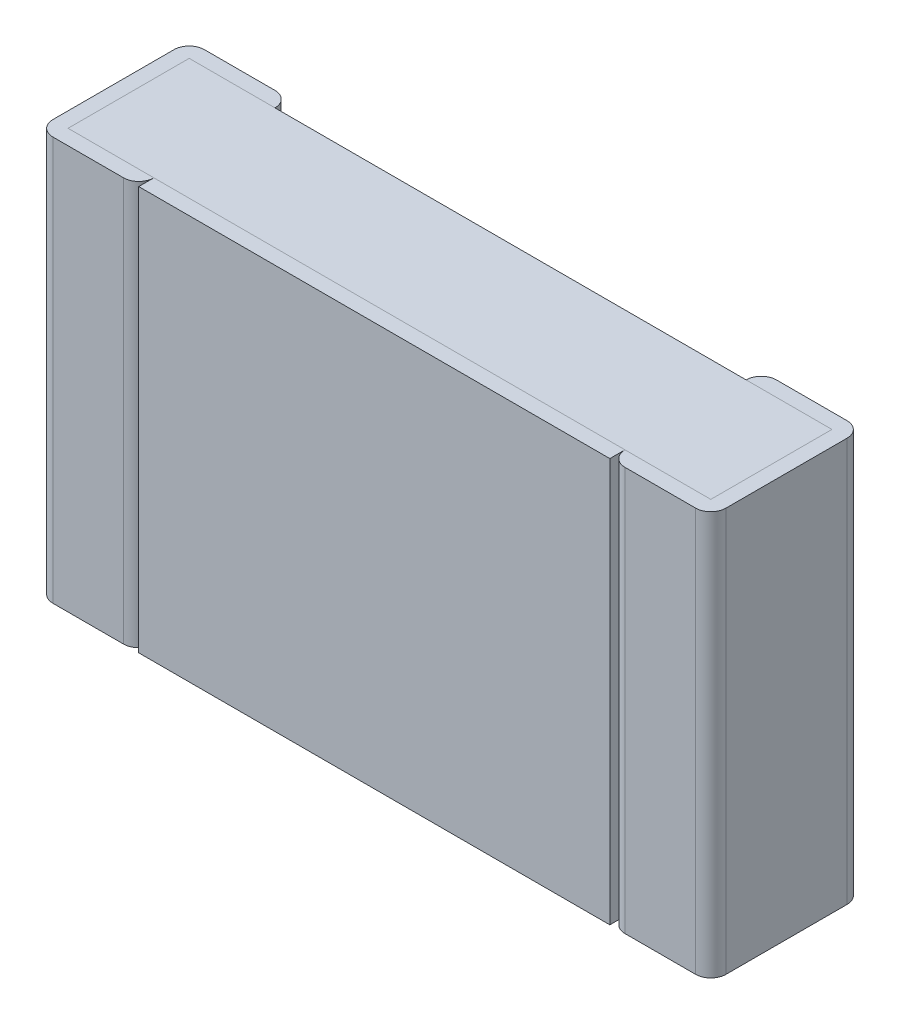
ISO-10303-21;
HEADER;
FILE_DESCRIPTION(('STEP AP214'),'2;1');
FILE_NAME('part.step','',(''),(''),'','','');
FILE_SCHEMA(('AUTOMOTIVE_DESIGN { 1 0 10303 214 1 1 1 1 }'));
ENDSEC;
DATA;
#1=APPLICATION_CONTEXT('core data for automotive mechanical design processes');
#2=APPLICATION_PROTOCOL_DEFINITION('international standard','automotive_design',2000,#1);
#3=PRODUCT_CONTEXT('',#1,'mechanical');
#4=PRODUCT('Part','Part','',(#3));
#5=PRODUCT_RELATED_PRODUCT_CATEGORY('part','',(#4));
#6=PRODUCT_DEFINITION_FORMATION('','',#4);
#7=PRODUCT_DEFINITION_CONTEXT('part definition',#1,'design');
#8=PRODUCT_DEFINITION('design','',#6,#7);
#9=PRODUCT_DEFINITION_SHAPE('','',#8);
#10=(LENGTH_UNIT() NAMED_UNIT(*) SI_UNIT(.MILLI.,.METRE.));
#11=(NAMED_UNIT(*) PLANE_ANGLE_UNIT() SI_UNIT($,.RADIAN.));
#12=(NAMED_UNIT(*) SI_UNIT($,.STERADIAN.) SOLID_ANGLE_UNIT());
#13=UNCERTAINTY_MEASURE_WITH_UNIT(LENGTH_MEASURE(1.E-05),#10,'distance_accuracy_value','');
#14=(GEOMETRIC_REPRESENTATION_CONTEXT(3) GLOBAL_UNCERTAINTY_ASSIGNED_CONTEXT((#13)) GLOBAL_UNIT_ASSIGNED_CONTEXT((#10,
#11,#12)) REPRESENTATION_CONTEXT('',''));
#15=CARTESIAN_POINT('',(0.,0.,0.));
#16=DIRECTION('',(0.,0.,1.));
#17=DIRECTION('',(1.,0.,0.));
#18=AXIS2_PLACEMENT_3D('',#15,#16,#17);
#19=CARTESIAN_POINT('',(-0.7,-0.6,0.45));
#20=DIRECTION('',(0.,0.,1.));
#21=DIRECTION('',(1.,0.,0.));
#22=AXIS2_PLACEMENT_3D('',#19,#20,#21);
#23=PLANE('',#22);
#24=DIRECTION('',(0.,1.,0.));
#25=VECTOR('',#24,1.);
#26=CARTESIAN_POINT('',(-0.7,-0.6,0.45));
#27=LINE('',#26,#25);
#28=CARTESIAN_POINT('',(-0.7,-0.6,0.45));
#29=VERTEX_POINT('',#28);
#30=CARTESIAN_POINT('',(-0.7,0.6,0.45));
#31=VERTEX_POINT('',#30);
#32=EDGE_CURVE('E380',#29,#31,#27,.T.);
#33=ORIENTED_EDGE('',*,*,#32,.F.);
#34=DIRECTION('',(1.,0.,0.));
#35=VECTOR('',#34,1.);
#36=CARTESIAN_POINT('',(-0.7,-0.6,0.45));
#37=LINE('',#36,#35);
#38=CARTESIAN_POINT('',(0.7,-0.6,0.45));
#39=VERTEX_POINT('',#38);
#40=EDGE_CURVE('E368',#29,#39,#37,.T.);
#41=ORIENTED_EDGE('',*,*,#40,.T.);
#42=DIRECTION('',(0.,1.,0.));
#43=VECTOR('',#42,1.);
#44=CARTESIAN_POINT('',(0.7,-0.6,0.45));
#45=LINE('',#44,#43);
#46=CARTESIAN_POINT('',(0.7,0.6,0.45));
#47=VERTEX_POINT('',#46);
#48=EDGE_CURVE('E11',#39,#47,#45,.T.);
#49=ORIENTED_EDGE('',*,*,#48,.T.);
#50=DIRECTION('',(1.,0.,0.));
#51=VECTOR('',#50,1.);
#52=CARTESIAN_POINT('',(-0.7,0.6,0.45));
#53=LINE('',#52,#51);
#54=EDGE_CURVE('E247',#31,#47,#53,.T.);
#55=ORIENTED_EDGE('',*,*,#54,.F.);
#56=EDGE_LOOP('',(#33,#41,#49,#55));
#57=FACE_BOUND('',#56,.T.);
#58=ADVANCED_FACE('F17',(#57),#23,.T.);
#59=CARTESIAN_POINT('',(0.7,-0.6,0.405));
#60=DIRECTION('',(1.,0.,0.));
#61=DIRECTION('',(0.,1.,0.));
#62=AXIS2_PLACEMENT_3D('',#59,#60,#61);
#63=PLANE('',#62);
#64=DIRECTION('',(0.,0.,1.));
#65=VECTOR('',#64,1.);
#66=CARTESIAN_POINT('',(0.7,-0.6,0.405));
#67=LINE('',#66,#65);
#68=CARTESIAN_POINT('',(0.7,-0.6,0.405));
#69=VERTEX_POINT('',#68);
#70=EDGE_CURVE('E347',#69,#39,#67,.T.);
#71=ORIENTED_EDGE('',*,*,#70,.F.);
#72=DIRECTION('',(0.,1.,0.));
#73=VECTOR('',#72,1.);
#74=CARTESIAN_POINT('',(0.7,-0.6,0.405));
#75=LINE('',#74,#73);
#76=CARTESIAN_POINT('',(0.7,0.6,0.405));
#77=VERTEX_POINT('',#76);
#78=EDGE_CURVE('E28',#69,#77,#75,.T.);
#79=ORIENTED_EDGE('',*,*,#78,.T.);
#80=DIRECTION('',(0.,0.,1.));
#81=VECTOR('',#80,1.);
#82=CARTESIAN_POINT('',(0.7,0.6,0.405));
#83=LINE('',#82,#81);
#84=EDGE_CURVE('E249',#77,#47,#83,.T.);
#85=ORIENTED_EDGE('',*,*,#84,.T.);
#86=ORIENTED_EDGE('',*,*,#48,.F.);
#87=EDGE_LOOP('',(#71,#79,#85,#86));
#88=FACE_BOUND('',#87,.T.);
#89=ADVANCED_FACE('F532',(#88),#63,.T.);
#90=CARTESIAN_POINT('',(0.745,-0.6,0.405));
#91=DIRECTION('',(0.,1.,0.));
#92=DIRECTION('',(-1.,0.,0.));
#93=AXIS2_PLACEMENT_3D('',#90,#91,#92);
#94=CYLINDRICAL_SURFACE('',#93,0.045);
#95=CARTESIAN_POINT('',(0.745,-0.6,0.405));
#96=DIRECTION('',(0.,1.,0.));
#97=DIRECTION('',(0.,0.,1.));
#98=AXIS2_PLACEMENT_3D('',#95,#96,#97);
#99=CIRCLE('',#98,0.045);
#100=CARTESIAN_POINT('',(0.745,-0.6,0.45));
#101=VERTEX_POINT('',#100);
#102=EDGE_CURVE('E21',#69,#101,#99,.T.);
#103=ORIENTED_EDGE('',*,*,#102,.T.);
#104=DIRECTION('',(0.,1.,0.));
#105=VECTOR('',#104,1.);
#106=CARTESIAN_POINT('',(0.745,-0.6,0.45));
#107=LINE('',#106,#105);
#108=CARTESIAN_POINT('',(0.745,0.6,0.45));
#109=VERTEX_POINT('',#108);
#110=EDGE_CURVE('E245',#101,#109,#107,.T.);
#111=ORIENTED_EDGE('',*,*,#110,.T.);
#112=CARTESIAN_POINT('',(0.745,0.6,0.405));
#113=DIRECTION('',(0.,1.,0.));
#114=DIRECTION('',(0.,0.,1.));
#115=AXIS2_PLACEMENT_3D('',#112,#113,#114);
#116=CIRCLE('',#115,0.045);
#117=EDGE_CURVE('E278',#77,#109,#116,.T.);
#118=ORIENTED_EDGE('',*,*,#117,.F.);
#119=ORIENTED_EDGE('',*,*,#78,.F.);
#120=EDGE_LOOP('',(#103,#111,#118,#119));
#121=FACE_BOUND('',#120,.T.);
#122=ADVANCED_FACE('F535',(#121),#94,.T.);
#123=CARTESIAN_POINT('',(0.7,-0.6,0.45));
#124=DIRECTION('',(0.,0.,1.));
#125=DIRECTION('',(1.,0.,0.));
#126=AXIS2_PLACEMENT_3D('',#123,#124,#125);
#127=PLANE('',#126);
#128=DIRECTION('',(1.,0.,0.));
#129=VECTOR('',#128,1.);
#130=CARTESIAN_POINT('',(0.7,0.6,0.45));
#131=LINE('',#130,#129);
#132=CARTESIAN_POINT('',(0.955,0.6,0.45));
#133=VERTEX_POINT('',#132);
#134=EDGE_CURVE('E281',#109,#133,#131,.T.);
#135=ORIENTED_EDGE('',*,*,#134,.F.);
#136=ORIENTED_EDGE('',*,*,#110,.F.);
#137=DIRECTION('',(1.,0.,0.));
#138=VECTOR('',#137,1.);
#139=CARTESIAN_POINT('',(0.7,-0.6,0.45));
#140=LINE('',#139,#138);
#141=CARTESIAN_POINT('',(0.955,-0.6,0.45));
#142=VERTEX_POINT('',#141);
#143=EDGE_CURVE('E306',#101,#142,#140,.T.);
#144=ORIENTED_EDGE('',*,*,#143,.T.);
#145=DIRECTION('',(0.,1.,0.));
#146=VECTOR('',#145,1.);
#147=CARTESIAN_POINT('',(0.955,-0.6,0.45));
#148=LINE('',#147,#146);
#149=EDGE_CURVE('E292',#142,#133,#148,.T.);
#150=ORIENTED_EDGE('',*,*,#149,.T.);
#151=EDGE_LOOP('',(#135,#136,#144,#150));
#152=FACE_BOUND('',#151,.T.);
#153=ADVANCED_FACE('F553',(#152),#127,.T.);
#154=CARTESIAN_POINT('',(0.955,-0.6,0.405));
#155=DIRECTION('',(0.,1.,0.));
#156=DIRECTION('',(1.,0.,0.));
#157=AXIS2_PLACEMENT_3D('',#154,#155,#156);
#158=CYLINDRICAL_SURFACE('',#157,0.045);
#159=DIRECTION('',(0.,1.,0.));
#160=VECTOR('',#159,1.);
#161=CARTESIAN_POINT('',(1.,-0.6,0.405));
#162=LINE('',#161,#160);
#163=CARTESIAN_POINT('',(1.,-0.6,0.405));
#164=VERTEX_POINT('',#163);
#165=CARTESIAN_POINT('',(1.,0.6,0.405));
#166=VERTEX_POINT('',#165);
#167=EDGE_CURVE('E295',#164,#166,#162,.T.);
#168=ORIENTED_EDGE('',*,*,#167,.T.);
#169=CARTESIAN_POINT('',(0.955,0.6,0.405));
#170=DIRECTION('',(0.,-1.,0.));
#171=DIRECTION('',(0.,0.,1.));
#172=AXIS2_PLACEMENT_3D('',#169,#170,#171);
#173=CIRCLE('',#172,0.045);
#174=EDGE_CURVE('E273',#166,#133,#173,.T.);
#175=ORIENTED_EDGE('',*,*,#174,.T.);
#176=ORIENTED_EDGE('',*,*,#149,.F.);
#177=CARTESIAN_POINT('',(0.955,-0.6,0.405));
#178=DIRECTION('',(0.,-1.,0.));
#179=DIRECTION('',(0.,0.,1.));
#180=AXIS2_PLACEMENT_3D('',#177,#178,#179);
#181=CIRCLE('',#180,0.045);
#182=EDGE_CURVE('E302',#164,#142,#181,.T.);
#183=ORIENTED_EDGE('',*,*,#182,.F.);
#184=EDGE_LOOP('',(#168,#175,#176,#183));
#185=FACE_BOUND('',#184,.T.);
#186=ADVANCED_FACE('F550',(#185),#158,.T.);
#187=CARTESIAN_POINT('',(1.,-0.6,0.));
#188=DIRECTION('',(1.,0.,0.));
#189=DIRECTION('',(0.,1.,0.));
#190=AXIS2_PLACEMENT_3D('',#187,#188,#189);
#191=PLANE('',#190);
#192=DIRECTION('',(0.,0.,1.));
#193=VECTOR('',#192,1.);
#194=CARTESIAN_POINT('',(1.,-0.6,0.));
#195=LINE('',#194,#193);
#196=CARTESIAN_POINT('',(1.,-0.6,0.045));
#197=VERTEX_POINT('',#196);
#198=EDGE_CURVE('E307',#197,#164,#195,.T.);
#199=ORIENTED_EDGE('',*,*,#198,.F.);
#200=DIRECTION('',(0.,1.,0.));
#201=VECTOR('',#200,1.);
#202=CARTESIAN_POINT('',(1.,-0.6,0.045));
#203=LINE('',#202,#201);
#204=CARTESIAN_POINT('',(1.,0.6,0.045));
#205=VERTEX_POINT('',#204);
#206=EDGE_CURVE('E332',#197,#205,#203,.T.);
#207=ORIENTED_EDGE('',*,*,#206,.T.);
#208=DIRECTION('',(0.,0.,1.));
#209=VECTOR('',#208,1.);
#210=CARTESIAN_POINT('',(1.,0.6,0.));
#211=LINE('',#210,#209);
#212=EDGE_CURVE('E261',#205,#166,#211,.T.);
#213=ORIENTED_EDGE('',*,*,#212,.T.);
#214=ORIENTED_EDGE('',*,*,#167,.F.);
#215=EDGE_LOOP('',(#199,#207,#213,#214));
#216=FACE_BOUND('',#215,.T.);
#217=ADVANCED_FACE('F547',(#216),#191,.T.);
#218=CARTESIAN_POINT('',(0.955,-0.6,0.045));
#219=DIRECTION('',(0.,1.,0.));
#220=DIRECTION('',(1.,0.,0.));
#221=AXIS2_PLACEMENT_3D('',#218,#219,#220);
#222=CYLINDRICAL_SURFACE('',#221,0.045);
#223=CARTESIAN_POINT('',(0.955,-0.6,0.045));
#224=DIRECTION('',(0.,1.,0.));
#225=DIRECTION('',(0.,0.,1.));
#226=AXIS2_PLACEMENT_3D('',#223,#224,#225);
#227=CIRCLE('',#226,0.045);
#228=CARTESIAN_POINT('',(0.955,-0.6,0.));
#229=VERTEX_POINT('',#228);
#230=EDGE_CURVE('E360',#197,#229,#227,.T.);
#231=ORIENTED_EDGE('',*,*,#230,.T.);
#232=DIRECTION('',(0.,1.,0.));
#233=VECTOR('',#232,1.);
#234=CARTESIAN_POINT('',(0.955,-0.6,0.));
#235=LINE('',#234,#233);
#236=CARTESIAN_POINT('',(0.955,0.6,0.));
#237=VERTEX_POINT('',#236);
#238=EDGE_CURVE('E339',#229,#237,#235,.T.);
#239=ORIENTED_EDGE('',*,*,#238,.T.);
#240=CARTESIAN_POINT('',(0.955,0.6,0.045));
#241=DIRECTION('',(0.,1.,0.));
#242=DIRECTION('',(0.,0.,1.));
#243=AXIS2_PLACEMENT_3D('',#240,#241,#242);
#244=CIRCLE('',#243,0.045);
#245=EDGE_CURVE('E250',#205,#237,#244,.T.);
#246=ORIENTED_EDGE('',*,*,#245,.F.);
#247=ORIENTED_EDGE('',*,*,#206,.F.);
#248=EDGE_LOOP('',(#231,#239,#246,#247));
#249=FACE_BOUND('',#248,.T.);
#250=ADVANCED_FACE('F544',(#249),#222,.T.);
#251=CARTESIAN_POINT('',(0.7,-0.6,0.));
#252=DIRECTION('',(0.,0.,1.));
#253=DIRECTION('',(1.,0.,0.));
#254=AXIS2_PLACEMENT_3D('',#251,#252,#253);
#255=PLANE('',#254);
#256=ORIENTED_EDGE('',*,*,#238,.F.);
#257=DIRECTION('',(1.,0.,0.));
#258=VECTOR('',#257,1.);
#259=CARTESIAN_POINT('',(0.7,-0.6,0.));
#260=LINE('',#259,#258);
#261=CARTESIAN_POINT('',(0.745,-0.6,0.));
#262=VERTEX_POINT('',#261);
#263=EDGE_CURVE('E344',#262,#229,#260,.T.);
#264=ORIENTED_EDGE('',*,*,#263,.F.);
#265=DIRECTION('',(0.,1.,0.));
#266=VECTOR('',#265,1.);
#267=CARTESIAN_POINT('',(0.745,-0.6,0.));
#268=LINE('',#267,#266);
#269=CARTESIAN_POINT('',(0.745,0.6,0.));
#270=VERTEX_POINT('',#269);
#271=EDGE_CURVE('E257',#262,#270,#268,.T.);
#272=ORIENTED_EDGE('',*,*,#271,.T.);
#273=DIRECTION('',(1.,0.,0.));
#274=VECTOR('',#273,1.);
#275=CARTESIAN_POINT('',(0.7,0.6,0.));
#276=LINE('',#275,#274);
#277=EDGE_CURVE('E364',#270,#237,#276,.T.);
#278=ORIENTED_EDGE('',*,*,#277,.T.);
#279=EDGE_LOOP('',(#256,#264,#272,#278));
#280=FACE_BOUND('',#279,.T.);
#281=ADVANCED_FACE('F542',(#280),#255,.F.);
#282=CARTESIAN_POINT('',(0.745,-0.6,0.045));
#283=DIRECTION('',(0.,1.,0.));
#284=DIRECTION('',(-1.,0.,0.));
#285=AXIS2_PLACEMENT_3D('',#282,#283,#284);
#286=CYLINDRICAL_SURFACE('',#285,0.045);
#287=DIRECTION('',(0.,1.,0.));
#288=VECTOR('',#287,1.);
#289=CARTESIAN_POINT('',(0.7,-0.6,0.045));
#290=LINE('',#289,#288);
#291=CARTESIAN_POINT('',(0.7,-0.6,0.045));
#292=VERTEX_POINT('',#291);
#293=CARTESIAN_POINT('',(0.7,0.6,0.045));
#294=VERTEX_POINT('',#293);
#295=EDGE_CURVE('E337',#292,#294,#290,.T.);
#296=ORIENTED_EDGE('',*,*,#295,.T.);
#297=CARTESIAN_POINT('',(0.745,0.6,0.045));
#298=DIRECTION('',(0.,-1.,0.));
#299=DIRECTION('',(0.,0.,1.));
#300=AXIS2_PLACEMENT_3D('',#297,#298,#299);
#301=CIRCLE('',#300,0.045);
#302=EDGE_CURVE('E282',#294,#270,#301,.T.);
#303=ORIENTED_EDGE('',*,*,#302,.T.);
#304=ORIENTED_EDGE('',*,*,#271,.F.);
#305=CARTESIAN_POINT('',(0.745,-0.6,0.045));
#306=DIRECTION('',(0.,-1.,0.));
#307=DIRECTION('',(0.,0.,1.));
#308=AXIS2_PLACEMENT_3D('',#305,#306,#307);
#309=CIRCLE('',#308,0.045);
#310=EDGE_CURVE('E348',#292,#262,#309,.T.);
#311=ORIENTED_EDGE('',*,*,#310,.F.);
#312=EDGE_LOOP('',(#296,#303,#304,#311));
#313=FACE_BOUND('',#312,.T.);
#314=ADVANCED_FACE('F539',(#313),#286,.T.);
#315=CARTESIAN_POINT('',(-0.7,0.6,0.405));
#316=DIRECTION('',(0.,1.,0.));
#317=DIRECTION('',(1.,0.,0.));
#318=AXIS2_PLACEMENT_3D('',#315,#316,#317);
#319=PLANE('',#318);
#320=DIRECTION('',(1.,0.,0.));
#321=VECTOR('',#320,1.);
#322=CARTESIAN_POINT('',(-0.7,0.6,0.405));
#323=LINE('',#322,#321);
#324=CARTESIAN_POINT('',(-0.7,0.6,0.405));
#325=VERTEX_POINT('',#324);
#326=EDGE_CURVE('E296',#325,#77,#323,.T.);
#327=ORIENTED_EDGE('',*,*,#326,.F.);
#328=DIRECTION('',(0.,0.,1.));
#329=VECTOR('',#328,1.);
#330=CARTESIAN_POINT('',(-0.7,0.6,0.405));
#331=LINE('',#330,#329);
#332=EDGE_CURVE('E391',#325,#31,#331,.T.);
#333=ORIENTED_EDGE('',*,*,#332,.T.);
#334=ORIENTED_EDGE('',*,*,#54,.T.);
#335=ORIENTED_EDGE('',*,*,#84,.F.);
#336=EDGE_LOOP('',(#327,#333,#334,#335));
#337=FACE_BOUND('',#336,.T.);
#338=ADVANCED_FACE('F523',(#337),#319,.T.);
#339=CARTESIAN_POINT('',(0.7,0.6,0.));
#340=DIRECTION('',(0.,1.,0.));
#341=DIRECTION('',(1.,0.,0.));
#342=AXIS2_PLACEMENT_3D('',#339,#340,#341);
#343=PLANE('',#342);
#344=ORIENTED_EDGE('',*,*,#277,.F.);
#345=ORIENTED_EDGE('',*,*,#302,.F.);
#346=DIRECTION('',(1.,0.,0.));
#347=VECTOR('',#346,1.);
#348=CARTESIAN_POINT('',(-0.955,0.6,0.045));
#349=LINE('',#348,#347);
#350=CARTESIAN_POINT('',(0.955,0.6,0.045));
#351=VERTEX_POINT('',#350);
#352=EDGE_CURVE('E317',#294,#351,#349,.T.);
#353=ORIENTED_EDGE('',*,*,#352,.T.);
#354=DIRECTION('',(0.,0.,1.));
#355=VECTOR('',#354,1.);
#356=CARTESIAN_POINT('',(0.955,0.6,0.045));
#357=LINE('',#356,#355);
#358=CARTESIAN_POINT('',(0.955,0.6,0.405));
#359=VERTEX_POINT('',#358);
#360=EDGE_CURVE('E314',#351,#359,#357,.T.);
#361=ORIENTED_EDGE('',*,*,#360,.T.);
#362=DIRECTION('',(1.,0.,0.));
#363=VECTOR('',#362,1.);
#364=CARTESIAN_POINT('',(-0.955,0.6,0.405));
#365=LINE('',#364,#363);
#366=EDGE_CURVE('E300',#77,#359,#365,.T.);
#367=ORIENTED_EDGE('',*,*,#366,.F.);
#368=ORIENTED_EDGE('',*,*,#117,.T.);
#369=ORIENTED_EDGE('',*,*,#134,.T.);
#370=ORIENTED_EDGE('',*,*,#174,.F.);
#371=ORIENTED_EDGE('',*,*,#212,.F.);
#372=ORIENTED_EDGE('',*,*,#245,.T.);
#373=EDGE_LOOP('',(#344,#345,#353,#361,#367,#368,#369,#370,#371,#372));
#374=FACE_BOUND('',#373,.T.);
#375=ADVANCED_FACE('F538',(#374),#343,.T.);
#376=CARTESIAN_POINT('',(-0.7,-0.6,0.405));
#377=DIRECTION('',(1.,0.,0.));
#378=DIRECTION('',(0.,1.,0.));
#379=AXIS2_PLACEMENT_3D('',#376,#377,#378);
#380=PLANE('',#379);
#381=ORIENTED_EDGE('',*,*,#32,.T.);
#382=ORIENTED_EDGE('',*,*,#332,.F.);
#383=DIRECTION('',(0.,1.,0.));
#384=VECTOR('',#383,1.);
#385=CARTESIAN_POINT('',(-0.7,-0.6,0.405));
#386=LINE('',#385,#384);
#387=CARTESIAN_POINT('',(-0.7,-0.6,0.405));
#388=VERTEX_POINT('',#387);
#389=EDGE_CURVE('E301',#388,#325,#386,.T.);
#390=ORIENTED_EDGE('',*,*,#389,.F.);
#391=DIRECTION('',(0.,0.,1.));
#392=VECTOR('',#391,1.);
#393=CARTESIAN_POINT('',(-0.7,-0.6,0.405));
#394=LINE('',#393,#392);
#395=EDGE_CURVE('E376',#388,#29,#394,.T.);
#396=ORIENTED_EDGE('',*,*,#395,.T.);
#397=EDGE_LOOP('',(#381,#382,#390,#396));
#398=FACE_BOUND('',#397,.T.);
#399=ADVANCED_FACE('F521',(#398),#380,.F.);
#400=CARTESIAN_POINT('',(-0.7,-0.6,0.405));
#401=DIRECTION('',(0.,1.,0.));
#402=DIRECTION('',(1.,0.,0.));
#403=AXIS2_PLACEMENT_3D('',#400,#401,#402);
#404=PLANE('',#403);
#405=ORIENTED_EDGE('',*,*,#70,.T.);
#406=ORIENTED_EDGE('',*,*,#40,.F.);
#407=ORIENTED_EDGE('',*,*,#395,.F.);
#408=DIRECTION('',(1.,0.,0.));
#409=VECTOR('',#408,1.);
#410=CARTESIAN_POINT('',(-0.7,-0.6,0.405));
#411=LINE('',#410,#409);
#412=EDGE_CURVE('E310',#388,#69,#411,.T.);
#413=ORIENTED_EDGE('',*,*,#412,.T.);
#414=EDGE_LOOP('',(#405,#406,#407,#413));
#415=FACE_BOUND('',#414,.T.);
#416=ADVANCED_FACE('F517',(#415),#404,.F.);
#417=CARTESIAN_POINT('',(0.7,-0.6,0.));
#418=DIRECTION('',(0.,1.,0.));
#419=DIRECTION('',(1.,0.,0.));
#420=AXIS2_PLACEMENT_3D('',#417,#418,#419);
#421=PLANE('',#420);
#422=ORIENTED_EDGE('',*,*,#230,.F.);
#423=ORIENTED_EDGE('',*,*,#198,.T.);
#424=ORIENTED_EDGE('',*,*,#182,.T.);
#425=ORIENTED_EDGE('',*,*,#143,.F.);
#426=ORIENTED_EDGE('',*,*,#102,.F.);
#427=DIRECTION('',(1.,0.,0.));
#428=VECTOR('',#427,1.);
#429=CARTESIAN_POINT('',(-0.955,-0.6,0.405));
#430=LINE('',#429,#428);
#431=CARTESIAN_POINT('',(0.955,-0.6,0.405));
#432=VERTEX_POINT('',#431);
#433=EDGE_CURVE('E287',#69,#432,#430,.T.);
#434=ORIENTED_EDGE('',*,*,#433,.T.);
#435=DIRECTION('',(0.,0.,1.));
#436=VECTOR('',#435,1.);
#437=CARTESIAN_POINT('',(0.955,-0.6,0.045));
#438=LINE('',#437,#436);
#439=CARTESIAN_POINT('',(0.955,-0.6,0.045));
#440=VERTEX_POINT('',#439);
#441=EDGE_CURVE('E283',#440,#432,#438,.T.);
#442=ORIENTED_EDGE('',*,*,#441,.F.);
#443=DIRECTION('',(1.,0.,0.));
#444=VECTOR('',#443,1.);
#445=CARTESIAN_POINT('',(-0.955,-0.6,0.045));
#446=LINE('',#445,#444);
#447=EDGE_CURVE('E288',#292,#440,#446,.T.);
#448=ORIENTED_EDGE('',*,*,#447,.F.);
#449=ORIENTED_EDGE('',*,*,#310,.T.);
#450=ORIENTED_EDGE('',*,*,#263,.T.);
#451=EDGE_LOOP('',(#422,#423,#424,#425,#426,#434,#442,#448,#449,#450));
#452=FACE_BOUND('',#451,.T.);
#453=ADVANCED_FACE('F512',(#452),#421,.F.);
#454=CARTESIAN_POINT('',(-0.955,-0.6,0.045));
#455=DIRECTION('',(0.,0.,1.));
#456=DIRECTION('',(1.,0.,0.));
#457=AXIS2_PLACEMENT_3D('',#454,#455,#456);
#458=PLANE('',#457);
#459=DIRECTION('',(1.,0.,0.));
#460=VECTOR('',#459,1.);
#461=CARTESIAN_POINT('',(-0.955,0.6,0.045));
#462=LINE('',#461,#460);
#463=CARTESIAN_POINT('',(-0.7,0.6,0.045));
#464=VERTEX_POINT('',#463);
#465=EDGE_CURVE('E333',#464,#294,#462,.T.);
#466=ORIENTED_EDGE('',*,*,#465,.T.);
#467=ORIENTED_EDGE('',*,*,#295,.F.);
#468=DIRECTION('',(1.,0.,0.));
#469=VECTOR('',#468,1.);
#470=CARTESIAN_POINT('',(-0.955,-0.6,0.045));
#471=LINE('',#470,#469);
#472=CARTESIAN_POINT('',(-0.7,-0.6,0.045));
#473=VERTEX_POINT('',#472);
#474=EDGE_CURVE('E321',#473,#292,#471,.T.);
#475=ORIENTED_EDGE('',*,*,#474,.F.);
#476=DIRECTION('',(0.,1.,0.));
#477=VECTOR('',#476,1.);
#478=CARTESIAN_POINT('',(-0.7,-0.6,0.045));
#479=LINE('',#478,#477);
#480=EDGE_CURVE('E436',#473,#464,#479,.T.);
#481=ORIENTED_EDGE('',*,*,#480,.T.);
#482=EDGE_LOOP('',(#466,#467,#475,#481));
#483=FACE_BOUND('',#482,.T.);
#484=ADVANCED_FACE('F507',(#483),#458,.F.);
#485=CARTESIAN_POINT('',(-0.955,0.6,0.045));
#486=DIRECTION('',(0.,1.,0.));
#487=DIRECTION('',(1.,0.,0.));
#488=AXIS2_PLACEMENT_3D('',#485,#486,#487);
#489=PLANE('',#488);
#490=DIRECTION('',(1.,0.,0.));
#491=VECTOR('',#490,1.);
#492=CARTESIAN_POINT('',(-0.955,0.6,0.045));
#493=LINE('',#492,#491);
#494=CARTESIAN_POINT('',(-0.955,0.6,0.045));
#495=VERTEX_POINT('',#494);
#496=EDGE_CURVE('E373',#495,#464,#493,.T.);
#497=ORIENTED_EDGE('',*,*,#496,.F.);
#498=DIRECTION('',(0.,0.,1.));
#499=VECTOR('',#498,1.);
#500=CARTESIAN_POINT('',(-0.955,0.6,0.045));
#501=LINE('',#500,#499);
#502=CARTESIAN_POINT('',(-0.955,0.6,0.405));
#503=VERTEX_POINT('',#502);
#504=EDGE_CURVE('E381',#495,#503,#501,.T.);
#505=ORIENTED_EDGE('',*,*,#504,.T.);
#506=DIRECTION('',(1.,0.,0.));
#507=VECTOR('',#506,1.);
#508=CARTESIAN_POINT('',(-0.955,0.6,0.405));
#509=LINE('',#508,#507);
#510=EDGE_CURVE('E384',#503,#325,#509,.T.);
#511=ORIENTED_EDGE('',*,*,#510,.T.);
#512=ORIENTED_EDGE('',*,*,#326,.T.);
#513=ORIENTED_EDGE('',*,*,#366,.T.);
#514=ORIENTED_EDGE('',*,*,#360,.F.);
#515=ORIENTED_EDGE('',*,*,#352,.F.);
#516=ORIENTED_EDGE('',*,*,#465,.F.);
#517=EDGE_LOOP('',(#497,#505,#511,#512,#513,#514,#515,#516));
#518=FACE_BOUND('',#517,.T.);
#519=ADVANCED_FACE('F526',(#518),#489,.T.);
#520=CARTESIAN_POINT('',(-0.745,-0.6,0.405));
#521=DIRECTION('',(0.,1.,0.));
#522=DIRECTION('',(1.,0.,0.));
#523=AXIS2_PLACEMENT_3D('',#520,#521,#522);
#524=CYLINDRICAL_SURFACE('',#523,0.045);
#525=ORIENTED_EDGE('',*,*,#389,.T.);
#526=CARTESIAN_POINT('',(-0.745,0.6,0.405));
#527=DIRECTION('',(0.,-1.,0.));
#528=DIRECTION('',(0.,0.,1.));
#529=AXIS2_PLACEMENT_3D('',#526,#527,#528);
#530=CIRCLE('',#529,0.045);
#531=CARTESIAN_POINT('',(-0.745,0.6,0.45));
#532=VERTEX_POINT('',#531);
#533=EDGE_CURVE('E276',#325,#532,#530,.T.);
#534=ORIENTED_EDGE('',*,*,#533,.T.);
#535=DIRECTION('',(0.,1.,0.));
#536=VECTOR('',#535,1.);
#537=CARTESIAN_POINT('',(-0.745,-0.6,0.45));
#538=LINE('',#537,#536);
#539=CARTESIAN_POINT('',(-0.745,-0.6,0.45));
#540=VERTEX_POINT('',#539);
#541=EDGE_CURVE('E422',#540,#532,#538,.T.);
#542=ORIENTED_EDGE('',*,*,#541,.F.);
#543=CARTESIAN_POINT('',(-0.745,-0.6,0.405));
#544=DIRECTION('',(0.,-1.,0.));
#545=DIRECTION('',(0.,0.,1.));
#546=AXIS2_PLACEMENT_3D('',#543,#544,#545);
#547=CIRCLE('',#546,0.045);
#548=EDGE_CURVE('E353',#388,#540,#547,.T.);
#549=ORIENTED_EDGE('',*,*,#548,.F.);
#550=EDGE_LOOP('',(#525,#534,#542,#549));
#551=FACE_BOUND('',#550,.T.);
#552=ADVANCED_FACE('F492',(#551),#524,.T.);
#553=CARTESIAN_POINT('',(-1.,-0.6,0.45));
#554=DIRECTION('',(0.,0.,1.));
#555=DIRECTION('',(1.,0.,0.));
#556=AXIS2_PLACEMENT_3D('',#553,#554,#555);
#557=PLANE('',#556);
#558=DIRECTION('',(1.,0.,0.));
#559=VECTOR('',#558,1.);
#560=CARTESIAN_POINT('',(-1.,0.6,0.45));
#561=LINE('',#560,#559);
#562=CARTESIAN_POINT('',(-0.955,0.6,0.45));
#563=VERTEX_POINT('',#562);
#564=EDGE_CURVE('E387',#563,#532,#561,.T.);
#565=ORIENTED_EDGE('',*,*,#564,.F.);
#566=DIRECTION('',(0.,1.,0.));
#567=VECTOR('',#566,1.);
#568=CARTESIAN_POINT('',(-0.955,-0.6,0.45));
#569=LINE('',#568,#567);
#570=CARTESIAN_POINT('',(-0.955,-0.6,0.45));
#571=VERTEX_POINT('',#570);
#572=EDGE_CURVE('E313',#571,#563,#569,.T.);
#573=ORIENTED_EDGE('',*,*,#572,.F.);
#574=DIRECTION('',(1.,0.,0.));
#575=VECTOR('',#574,1.);
#576=CARTESIAN_POINT('',(-1.,-0.6,0.45));
#577=LINE('',#576,#575);
#578=EDGE_CURVE('E326',#571,#540,#577,.T.);
#579=ORIENTED_EDGE('',*,*,#578,.T.);
#580=ORIENTED_EDGE('',*,*,#541,.T.);
#581=EDGE_LOOP('',(#565,#573,#579,#580));
#582=FACE_BOUND('',#581,.T.);
#583=ADVANCED_FACE('F489',(#582),#557,.T.);
#584=CARTESIAN_POINT('',(-0.955,-0.6,0.045));
#585=DIRECTION('',(0.,1.,0.));
#586=DIRECTION('',(1.,0.,0.));
#587=AXIS2_PLACEMENT_3D('',#584,#585,#586);
#588=PLANE('',#587);
#589=ORIENTED_EDGE('',*,*,#474,.T.);
#590=ORIENTED_EDGE('',*,*,#447,.T.);
#591=ORIENTED_EDGE('',*,*,#441,.T.);
#592=ORIENTED_EDGE('',*,*,#433,.F.);
#593=ORIENTED_EDGE('',*,*,#412,.F.);
#594=DIRECTION('',(1.,0.,0.));
#595=VECTOR('',#594,1.);
#596=CARTESIAN_POINT('',(-0.955,-0.6,0.405));
#597=LINE('',#596,#595);
#598=CARTESIAN_POINT('',(-0.955,-0.6,0.405));
#599=VERTEX_POINT('',#598);
#600=EDGE_CURVE('E423',#599,#388,#597,.T.);
#601=ORIENTED_EDGE('',*,*,#600,.F.);
#602=DIRECTION('',(0.,0.,1.));
#603=VECTOR('',#602,1.);
#604=CARTESIAN_POINT('',(-0.955,-0.6,0.045));
#605=LINE('',#604,#603);
#606=CARTESIAN_POINT('',(-0.955,-0.6,0.045));
#607=VERTEX_POINT('',#606);
#608=EDGE_CURVE('E426',#607,#599,#605,.T.);
#609=ORIENTED_EDGE('',*,*,#608,.F.);
#610=DIRECTION('',(1.,0.,0.));
#611=VECTOR('',#610,1.);
#612=CARTESIAN_POINT('',(-0.955,-0.6,0.045));
#613=LINE('',#612,#611);
#614=EDGE_CURVE('E415',#607,#473,#613,.T.);
#615=ORIENTED_EDGE('',*,*,#614,.T.);
#616=EDGE_LOOP('',(#589,#590,#591,#592,#593,#601,#609,#615));
#617=FACE_BOUND('',#616,.T.);
#618=ADVANCED_FACE('F502',(#617),#588,.F.);
#619=CARTESIAN_POINT('',(-0.745,-0.6,0.045));
#620=DIRECTION('',(0.,1.,0.));
#621=DIRECTION('',(1.,0.,0.));
#622=AXIS2_PLACEMENT_3D('',#619,#620,#621);
#623=CYLINDRICAL_SURFACE('',#622,0.045);
#624=CARTESIAN_POINT('',(-0.745,-0.6,0.045));
#625=DIRECTION('',(0.,1.,0.));
#626=DIRECTION('',(0.,0.,1.));
#627=AXIS2_PLACEMENT_3D('',#624,#625,#626);
#628=CIRCLE('',#627,0.045);
#629=CARTESIAN_POINT('',(-0.745,-0.6,0.));
#630=VERTEX_POINT('',#629);
#631=EDGE_CURVE('E411',#473,#630,#628,.T.);
#632=ORIENTED_EDGE('',*,*,#631,.T.);
#633=DIRECTION('',(0.,1.,0.));
#634=VECTOR('',#633,1.);
#635=CARTESIAN_POINT('',(-0.745,-0.6,0.));
#636=LINE('',#635,#634);
#637=CARTESIAN_POINT('',(-0.745,0.6,0.));
#638=VERTEX_POINT('',#637);
#639=EDGE_CURVE('E372',#630,#638,#636,.T.);
#640=ORIENTED_EDGE('',*,*,#639,.T.);
#641=CARTESIAN_POINT('',(-0.745,0.6,0.045));
#642=DIRECTION('',(0.,1.,0.));
#643=DIRECTION('',(0.,0.,1.));
#644=AXIS2_PLACEMENT_3D('',#641,#642,#643);
#645=CIRCLE('',#644,0.045);
#646=EDGE_CURVE('E369',#464,#638,#645,.T.);
#647=ORIENTED_EDGE('',*,*,#646,.F.);
#648=ORIENTED_EDGE('',*,*,#480,.F.);
#649=EDGE_LOOP('',(#632,#640,#647,#648));
#650=FACE_BOUND('',#649,.T.);
#651=ADVANCED_FACE('F472',(#650),#623,.T.);
#652=CARTESIAN_POINT('',(-1.,-0.6,0.));
#653=DIRECTION('',(0.,0.,1.));
#654=DIRECTION('',(1.,0.,0.));
#655=AXIS2_PLACEMENT_3D('',#652,#653,#654);
#656=PLANE('',#655);
#657=ORIENTED_EDGE('',*,*,#639,.F.);
#658=DIRECTION('',(1.,0.,0.));
#659=VECTOR('',#658,1.);
#660=CARTESIAN_POINT('',(-1.,-0.6,0.));
#661=LINE('',#660,#659);
#662=CARTESIAN_POINT('',(-0.955,-0.6,0.));
#663=VERTEX_POINT('',#662);
#664=EDGE_CURVE('E221',#663,#630,#661,.T.);
#665=ORIENTED_EDGE('',*,*,#664,.F.);
#666=DIRECTION('',(0.,1.,0.));
#667=VECTOR('',#666,1.);
#668=CARTESIAN_POINT('',(-0.955,-0.6,0.));
#669=LINE('',#668,#667);
#670=CARTESIAN_POINT('',(-0.955,0.6,0.));
#671=VERTEX_POINT('',#670);
#672=EDGE_CURVE('E220',#663,#671,#669,.T.);
#673=ORIENTED_EDGE('',*,*,#672,.T.);
#674=DIRECTION('',(1.,0.,0.));
#675=VECTOR('',#674,1.);
#676=CARTESIAN_POINT('',(-1.,0.6,0.));
#677=LINE('',#676,#675);
#678=EDGE_CURVE('E216',#671,#638,#677,.T.);
#679=ORIENTED_EDGE('',*,*,#678,.T.);
#680=EDGE_LOOP('',(#657,#665,#673,#679));
#681=FACE_BOUND('',#680,.T.);
#682=ADVANCED_FACE('F478',(#681),#656,.F.);
#683=CARTESIAN_POINT('',(-1.,0.6,0.));
#684=DIRECTION('',(0.,1.,0.));
#685=DIRECTION('',(1.,0.,0.));
#686=AXIS2_PLACEMENT_3D('',#683,#684,#685);
#687=PLANE('',#686);
#688=ORIENTED_EDGE('',*,*,#678,.F.);
#689=CARTESIAN_POINT('',(-0.955,0.6,0.045));
#690=DIRECTION('',(0.,-1.,0.));
#691=DIRECTION('',(0.,0.,1.));
#692=AXIS2_PLACEMENT_3D('',#689,#690,#691);
#693=CIRCLE('',#692,0.045);
#694=CARTESIAN_POINT('',(-1.,0.6,0.045));
#695=VERTEX_POINT('',#694);
#696=EDGE_CURVE('E208',#695,#671,#693,.T.);
#697=ORIENTED_EDGE('',*,*,#696,.F.);
#698=DIRECTION('',(0.,0.,1.));
#699=VECTOR('',#698,1.);
#700=CARTESIAN_POINT('',(-1.,0.6,0.));
#701=LINE('',#700,#699);
#702=CARTESIAN_POINT('',(-1.,0.6,0.405));
#703=VERTEX_POINT('',#702);
#704=EDGE_CURVE('E212',#695,#703,#701,.T.);
#705=ORIENTED_EDGE('',*,*,#704,.T.);
#706=CARTESIAN_POINT('',(-0.955,0.6,0.405));
#707=DIRECTION('',(0.,1.,0.));
#708=DIRECTION('',(0.,0.,1.));
#709=AXIS2_PLACEMENT_3D('',#706,#707,#708);
#710=CIRCLE('',#709,0.045);
#711=EDGE_CURVE('E341',#703,#563,#710,.T.);
#712=ORIENTED_EDGE('',*,*,#711,.T.);
#713=ORIENTED_EDGE('',*,*,#564,.T.);
#714=ORIENTED_EDGE('',*,*,#533,.F.);
#715=ORIENTED_EDGE('',*,*,#510,.F.);
#716=ORIENTED_EDGE('',*,*,#504,.F.);
#717=ORIENTED_EDGE('',*,*,#496,.T.);
#718=ORIENTED_EDGE('',*,*,#646,.T.);
#719=EDGE_LOOP('',(#688,#697,#705,#712,#713,#714,#715,#716,#717,#718));
#720=FACE_BOUND('',#719,.T.);
#721=ADVANCED_FACE('F19',(#720),#687,.T.);
#722=CARTESIAN_POINT('',(-0.955,-0.6,0.405));
#723=DIRECTION('',(0.,1.,0.));
#724=DIRECTION('',(-1.,0.,0.));
#725=AXIS2_PLACEMENT_3D('',#722,#723,#724);
#726=CYLINDRICAL_SURFACE('',#725,0.045);
#727=CARTESIAN_POINT('',(-0.955,-0.6,0.405));
#728=DIRECTION('',(0.,1.,0.));
#729=DIRECTION('',(0.,0.,1.));
#730=AXIS2_PLACEMENT_3D('',#727,#728,#729);
#731=CIRCLE('',#730,0.045);
#732=CARTESIAN_POINT('',(-1.,-0.6,0.405));
#733=VERTEX_POINT('',#732);
#734=EDGE_CURVE('E322',#733,#571,#731,.T.);
#735=ORIENTED_EDGE('',*,*,#734,.T.);
#736=ORIENTED_EDGE('',*,*,#572,.T.);
#737=ORIENTED_EDGE('',*,*,#711,.F.);
#738=DIRECTION('',(0.,1.,0.));
#739=VECTOR('',#738,1.);
#740=CARTESIAN_POINT('',(-1.,-0.6,0.405));
#741=LINE('',#740,#739);
#742=EDGE_CURVE('E236',#733,#703,#741,.T.);
#743=ORIENTED_EDGE('',*,*,#742,.F.);
#744=EDGE_LOOP('',(#735,#736,#737,#743));
#745=FACE_BOUND('',#744,.T.);
#746=ADVANCED_FACE('F484',(#745),#726,.T.);
#747=CARTESIAN_POINT('',(-0.955,-0.6,0.045));
#748=DIRECTION('',(0.,1.,0.));
#749=DIRECTION('',(-1.,0.,0.));
#750=AXIS2_PLACEMENT_3D('',#747,#748,#749);
#751=CYLINDRICAL_SURFACE('',#750,0.045);
#752=DIRECTION('',(0.,1.,0.));
#753=VECTOR('',#752,1.);
#754=CARTESIAN_POINT('',(-1.,-0.6,0.045));
#755=LINE('',#754,#753);
#756=CARTESIAN_POINT('',(-1.,-0.6,0.045));
#757=VERTEX_POINT('',#756);
#758=EDGE_CURVE('E224',#757,#695,#755,.T.);
#759=ORIENTED_EDGE('',*,*,#758,.T.);
#760=ORIENTED_EDGE('',*,*,#696,.T.);
#761=ORIENTED_EDGE('',*,*,#672,.F.);
#762=CARTESIAN_POINT('',(-0.955,-0.6,0.045));
#763=DIRECTION('',(0.,-1.,0.));
#764=DIRECTION('',(0.,0.,1.));
#765=AXIS2_PLACEMENT_3D('',#762,#763,#764);
#766=CIRCLE('',#765,0.045);
#767=EDGE_CURVE('E227',#757,#663,#766,.T.);
#768=ORIENTED_EDGE('',*,*,#767,.F.);
#769=EDGE_LOOP('',(#759,#760,#761,#768));
#770=FACE_BOUND('',#769,.T.);
#771=ADVANCED_FACE('F225',(#770),#751,.T.);
#772=CARTESIAN_POINT('',(-1.,-0.6,0.));
#773=DIRECTION('',(0.,1.,0.));
#774=DIRECTION('',(1.,0.,0.));
#775=AXIS2_PLACEMENT_3D('',#772,#773,#774);
#776=PLANE('',#775);
#777=ORIENTED_EDGE('',*,*,#631,.F.);
#778=ORIENTED_EDGE('',*,*,#614,.F.);
#779=ORIENTED_EDGE('',*,*,#608,.T.);
#780=ORIENTED_EDGE('',*,*,#600,.T.);
#781=ORIENTED_EDGE('',*,*,#548,.T.);
#782=ORIENTED_EDGE('',*,*,#578,.F.);
#783=ORIENTED_EDGE('',*,*,#734,.F.);
#784=DIRECTION('',(0.,0.,1.));
#785=VECTOR('',#784,1.);
#786=CARTESIAN_POINT('',(-1.,-0.6,0.));
#787=LINE('',#786,#785);
#788=EDGE_CURVE('E232',#757,#733,#787,.T.);
#789=ORIENTED_EDGE('',*,*,#788,.F.);
#790=ORIENTED_EDGE('',*,*,#767,.T.);
#791=ORIENTED_EDGE('',*,*,#664,.T.);
#792=EDGE_LOOP('',(#777,#778,#779,#780,#781,#782,#783,#789,#790,#791));
#793=FACE_BOUND('',#792,.T.);
#794=ADVANCED_FACE('F480',(#793),#776,.F.);
#795=CARTESIAN_POINT('',(-1.,-0.6,0.));
#796=DIRECTION('',(1.,0.,0.));
#797=DIRECTION('',(0.,1.,0.));
#798=AXIS2_PLACEMENT_3D('',#795,#796,#797);
#799=PLANE('',#798);
#800=ORIENTED_EDGE('',*,*,#742,.T.);
#801=ORIENTED_EDGE('',*,*,#704,.F.);
#802=ORIENTED_EDGE('',*,*,#758,.F.);
#803=ORIENTED_EDGE('',*,*,#788,.T.);
#804=EDGE_LOOP('',(#800,#801,#802,#803));
#805=FACE_BOUND('',#804,.T.);
#806=ADVANCED_FACE('F234',(#805),#799,.F.);
#807=CLOSED_SHELL('',(#58,#89,#122,#153,#186,#217,#250,#281,#314,#338,#375,#399,#416,#453,#484,
#519,#552,#583,#618,#651,#682,#721,#746,#771,#794,#806));
#808=MANIFOLD_SOLID_BREP('B1',#807);
#809=ADVANCED_BREP_SHAPE_REPRESENTATION('',(#18,#808),#14);
#810=SHAPE_DEFINITION_REPRESENTATION(#9,#809);
ENDSEC;
END-ISO-10303-21;
